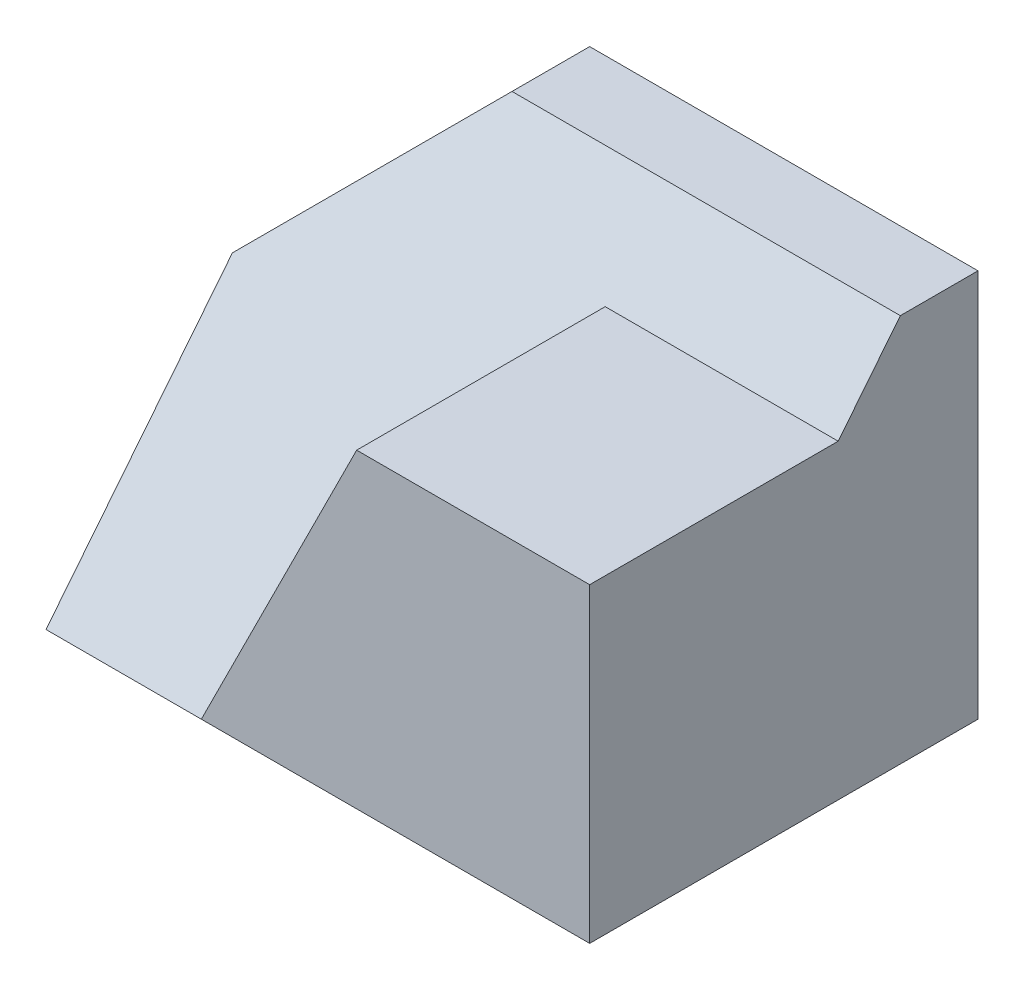
ISO-10303-21;
HEADER;
FILE_DESCRIPTION(('STEP AP214'),'2;1');
FILE_NAME('part.step','',(''),(''),'','','');
FILE_SCHEMA(('AUTOMOTIVE_DESIGN { 1 0 10303 214 1 1 1 1 }'));
ENDSEC;
DATA;
#1=APPLICATION_CONTEXT('core data for automotive mechanical design processes');
#2=APPLICATION_PROTOCOL_DEFINITION('international standard','automotive_design',2000,#1);
#3=PRODUCT_CONTEXT('',#1,'mechanical');
#4=PRODUCT('Part','Part','',(#3));
#5=PRODUCT_RELATED_PRODUCT_CATEGORY('part','',(#4));
#6=PRODUCT_DEFINITION_FORMATION('','',#4);
#7=PRODUCT_DEFINITION_CONTEXT('part definition',#1,'design');
#8=PRODUCT_DEFINITION('design','',#6,#7);
#9=PRODUCT_DEFINITION_SHAPE('','',#8);
#10=(LENGTH_UNIT() NAMED_UNIT(*) SI_UNIT(.MILLI.,.METRE.));
#11=(NAMED_UNIT(*) PLANE_ANGLE_UNIT() SI_UNIT($,.RADIAN.));
#12=(NAMED_UNIT(*) SI_UNIT($,.STERADIAN.) SOLID_ANGLE_UNIT());
#13=UNCERTAINTY_MEASURE_WITH_UNIT(LENGTH_MEASURE(1.E-05),#10,'distance_accuracy_value','');
#14=(GEOMETRIC_REPRESENTATION_CONTEXT(3) GLOBAL_UNCERTAINTY_ASSIGNED_CONTEXT((#13)) GLOBAL_UNIT_ASSIGNED_CONTEXT((#10,
#11,#12)) REPRESENTATION_CONTEXT('',''));
#15=CARTESIAN_POINT('',(0.,0.,0.));
#16=DIRECTION('',(0.,0.,1.));
#17=DIRECTION('',(1.,0.,0.));
#18=AXIS2_PLACEMENT_3D('',#15,#16,#17);
#19=CARTESIAN_POINT('',(0.,24.390243902439,30.4878048780488));
#20=DIRECTION('',(0.,0.624695047554424,0.78086880944303));
#21=DIRECTION('',(0.,-0.78086880944303,0.624695047554424));
#22=AXIS2_PLACEMENT_3D('',#19,#20,#21);
#23=PLANE('',#22);
#24=DIRECTION('',(1.,0.,0.));
#25=VECTOR('',#24,1.);
#26=CARTESIAN_POINT('',(0.,0.,50.));
#27=LINE('',#26,#25);
#28=CARTESIAN_POINT('',(0.,0.,50.));
#29=VERTEX_POINT('',#28);
#30=CARTESIAN_POINT('',(20.,0.,50.));
#31=VERTEX_POINT('',#30);
#32=EDGE_CURVE('E110',#29,#31,#27,.T.);
#33=ORIENTED_EDGE('',*,*,#32,.T.);
#34=DIRECTION('',(-0.363696483726654,-0.727392967453308,0.581914373962646));
#35=VECTOR('',#34,1.);
#36=CARTESIAN_POINT('',(27.9365079365079,15.8730158730159,37.3015873015873));
#37=LINE('',#36,#35);
#38=CARTESIAN_POINT('',(40.,40.,18.));
#39=VERTEX_POINT('',#38);
#40=EDGE_CURVE('E11',#39,#31,#37,.T.);
#41=ORIENTED_EDGE('',*,*,#40,.F.);
#42=DIRECTION('',(-1.,0.,0.));
#43=VECTOR('',#42,1.);
#44=CARTESIAN_POINT('',(0.,40.,18.));
#45=LINE('',#44,#43);
#46=CARTESIAN_POINT('',(70.,40.,18.));
#47=VERTEX_POINT('',#46);
#48=EDGE_CURVE('E57',#47,#39,#45,.T.);
#49=ORIENTED_EDGE('',*,*,#48,.F.);
#50=DIRECTION('',(0.,0.780868809443031,-0.624695047554424));
#51=VECTOR('',#50,1.);
#52=CARTESIAN_POINT('',(70.,50.,10.));
#53=LINE('',#52,#51);
#54=CARTESIAN_POINT('',(70.,50.,10.));
#55=VERTEX_POINT('',#54);
#56=EDGE_CURVE('E125',#47,#55,#53,.T.);
#57=ORIENTED_EDGE('',*,*,#56,.T.);
#58=DIRECTION('',(1.,0.,0.));
#59=VECTOR('',#58,1.);
#60=CARTESIAN_POINT('',(-11.,50.,10.));
#61=LINE('',#60,#59);
#62=CARTESIAN_POINT('',(20.,50.,10.));
#63=VERTEX_POINT('',#62);
#64=EDGE_CURVE('E133',#63,#55,#61,.T.);
#65=ORIENTED_EDGE('',*,*,#64,.F.);
#66=DIRECTION('',(0.615457454896664,0.615457454896664,-0.492365963917331));
#67=VECTOR('',#66,1.);
#68=CARTESIAN_POINT('',(23.030303030303,53.030303030303,7.57575757575759));
#69=LINE('',#68,#67);
#70=CARTESIAN_POINT('',(0.,30.,26.));
#71=VERTEX_POINT('',#70);
#72=EDGE_CURVE('E39',#71,#63,#69,.T.);
#73=ORIENTED_EDGE('',*,*,#72,.F.);
#74=DIRECTION('',(0.,0.780868809443031,-0.624695047554424));
#75=VECTOR('',#74,1.);
#76=CARTESIAN_POINT('',(0.,0.,50.));
#77=LINE('',#76,#75);
#78=EDGE_CURVE('E127',#29,#71,#77,.T.);
#79=ORIENTED_EDGE('',*,*,#78,.F.);
#80=EDGE_LOOP('',(#33,#41,#49,#57,#65,#73,#79));
#81=FACE_BOUND('',#80,.T.);
#82=ADVANCED_FACE('F35',(#81),#23,.T.);
#83=CARTESIAN_POINT('',(0.,0.,50.));
#84=DIRECTION('',(0.,0.,-1.));
#85=DIRECTION('',(-1.,0.,0.));
#86=AXIS2_PLACEMENT_3D('',#83,#84,#85);
#87=PLANE('',#86);
#88=DIRECTION('',(-0.447213595499958,-0.894427190999916,0.));
#89=VECTOR('',#88,1.);
#90=CARTESIAN_POINT('',(40.,40.,50.));
#91=LINE('',#90,#89);
#92=CARTESIAN_POINT('',(40.,40.,50.));
#93=VERTEX_POINT('',#92);
#94=EDGE_CURVE('E124',#93,#31,#91,.T.);
#95=ORIENTED_EDGE('',*,*,#94,.T.);
#96=DIRECTION('',(-1.,0.,0.));
#97=VECTOR('',#96,1.);
#98=CARTESIAN_POINT('',(0.,0.,50.));
#99=LINE('',#98,#97);
#100=CARTESIAN_POINT('',(70.,0.,50.));
#101=VERTEX_POINT('',#100);
#102=EDGE_CURVE('E115',#101,#31,#99,.T.);
#103=ORIENTED_EDGE('',*,*,#102,.F.);
#104=DIRECTION('',(0.,1.,0.));
#105=VECTOR('',#104,1.);
#106=CARTESIAN_POINT('',(70.,0.,50.));
#107=LINE('',#106,#105);
#108=CARTESIAN_POINT('',(70.,40.,50.));
#109=VERTEX_POINT('',#108);
#110=EDGE_CURVE('E100',#101,#109,#107,.T.);
#111=ORIENTED_EDGE('',*,*,#110,.T.);
#112=DIRECTION('',(1.,0.,0.));
#113=VECTOR('',#112,1.);
#114=CARTESIAN_POINT('',(-11.,40.,50.));
#115=LINE('',#114,#113);
#116=EDGE_CURVE('E132',#93,#109,#115,.T.);
#117=ORIENTED_EDGE('',*,*,#116,.F.);
#118=EDGE_LOOP('',(#95,#103,#111,#117));
#119=FACE_BOUND('',#118,.T.);
#120=ADVANCED_FACE('F123',(#119),#87,.F.);
#121=CARTESIAN_POINT('',(-11.,40.,50.));
#122=DIRECTION('',(0.,-1.,0.));
#123=DIRECTION('',(0.,0.,-1.));
#124=AXIS2_PLACEMENT_3D('',#121,#122,#123);
#125=PLANE('',#124);
#126=DIRECTION('',(0.,0.,-1.));
#127=VECTOR('',#126,1.);
#128=CARTESIAN_POINT('',(70.,40.,50.));
#129=LINE('',#128,#127);
#130=EDGE_CURVE('E106',#109,#47,#129,.T.);
#131=ORIENTED_EDGE('',*,*,#130,.T.);
#132=ORIENTED_EDGE('',*,*,#48,.T.);
#133=DIRECTION('',(0.,0.,1.));
#134=VECTOR('',#133,1.);
#135=CARTESIAN_POINT('',(40.,40.,9.99999999999999));
#136=LINE('',#135,#134);
#137=EDGE_CURVE('E139',#39,#93,#136,.T.);
#138=ORIENTED_EDGE('',*,*,#137,.T.);
#139=ORIENTED_EDGE('',*,*,#116,.T.);
#140=EDGE_LOOP('',(#131,#132,#138,#139));
#141=FACE_BOUND('',#140,.T.);
#142=ADVANCED_FACE('F191',(#141),#125,.F.);
#143=CARTESIAN_POINT('',(40.,40.,9.99999999999999));
#144=DIRECTION('',(-0.894427190999916,0.447213595499958,0.));
#145=DIRECTION('',(-0.447213595499958,-0.894427190999916,0.));
#146=AXIS2_PLACEMENT_3D('',#143,#144,#145);
#147=PLANE('',#146);
#148=ORIENTED_EDGE('',*,*,#40,.T.);
#149=ORIENTED_EDGE('',*,*,#94,.F.);
#150=ORIENTED_EDGE('',*,*,#137,.F.);
#151=EDGE_LOOP('',(#148,#149,#150));
#152=FACE_BOUND('',#151,.T.);
#153=ADVANCED_FACE('F196',(#152),#147,.T.);
#154=CARTESIAN_POINT('',(0.,0.,50.));
#155=DIRECTION('',(1.,0.,0.));
#156=DIRECTION('',(0.,0.,-1.));
#157=AXIS2_PLACEMENT_3D('',#154,#155,#156);
#158=PLANE('',#157);
#159=ORIENTED_EDGE('',*,*,#78,.T.);
#160=DIRECTION('',(0.,0.,1.));
#161=VECTOR('',#160,1.);
#162=CARTESIAN_POINT('',(0.,30.,0.));
#163=LINE('',#162,#161);
#164=CARTESIAN_POINT('',(0.,30.,0.));
#165=VERTEX_POINT('',#164);
#166=EDGE_CURVE('E121',#165,#71,#163,.T.);
#167=ORIENTED_EDGE('',*,*,#166,.F.);
#168=DIRECTION('',(0.,-1.,0.));
#169=VECTOR('',#168,1.);
#170=CARTESIAN_POINT('',(0.,0.,0.));
#171=LINE('',#170,#169);
#172=CARTESIAN_POINT('',(0.,0.,0.));
#173=VERTEX_POINT('',#172);
#174=EDGE_CURVE('E147',#165,#173,#171,.T.);
#175=ORIENTED_EDGE('',*,*,#174,.T.);
#176=DIRECTION('',(0.,0.,-1.));
#177=VECTOR('',#176,1.);
#178=CARTESIAN_POINT('',(0.,0.,50.));
#179=LINE('',#178,#177);
#180=EDGE_CURVE('E142',#29,#173,#179,.T.);
#181=ORIENTED_EDGE('',*,*,#180,.F.);
#182=EDGE_LOOP('',(#159,#167,#175,#181));
#183=FACE_BOUND('',#182,.T.);
#184=ADVANCED_FACE('F37',(#183),#158,.F.);
#185=CARTESIAN_POINT('',(0.,0.,0.));
#186=DIRECTION('',(0.,0.,-1.));
#187=DIRECTION('',(-1.,0.,0.));
#188=AXIS2_PLACEMENT_3D('',#185,#186,#187);
#189=PLANE('',#188);
#190=ORIENTED_EDGE('',*,*,#174,.F.);
#191=DIRECTION('',(0.707106781186548,0.707106781186548,0.));
#192=VECTOR('',#191,1.);
#193=CARTESIAN_POINT('',(20.,50.,0.));
#194=LINE('',#193,#192);
#195=CARTESIAN_POINT('',(20.,50.,0.));
#196=VERTEX_POINT('',#195);
#197=EDGE_CURVE('E131',#165,#196,#194,.T.);
#198=ORIENTED_EDGE('',*,*,#197,.T.);
#199=DIRECTION('',(-1.,0.,0.));
#200=VECTOR('',#199,1.);
#201=CARTESIAN_POINT('',(0.,50.,0.));
#202=LINE('',#201,#200);
#203=CARTESIAN_POINT('',(70.,50.,0.));
#204=VERTEX_POINT('',#203);
#205=EDGE_CURVE('E44',#204,#196,#202,.T.);
#206=ORIENTED_EDGE('',*,*,#205,.F.);
#207=DIRECTION('',(0.,1.,0.));
#208=VECTOR('',#207,1.);
#209=CARTESIAN_POINT('',(70.,0.,0.));
#210=LINE('',#209,#208);
#211=CARTESIAN_POINT('',(70.,0.,0.));
#212=VERTEX_POINT('',#211);
#213=EDGE_CURVE('E120',#212,#204,#210,.T.);
#214=ORIENTED_EDGE('',*,*,#213,.F.);
#215=DIRECTION('',(1.,0.,0.));
#216=VECTOR('',#215,1.);
#217=CARTESIAN_POINT('',(0.,0.,0.));
#218=LINE('',#217,#216);
#219=CARTESIAN_POINT('',(44.390243902439,0.,0.));
#220=VERTEX_POINT('',#219);
#221=EDGE_CURVE('E118',#220,#212,#218,.T.);
#222=ORIENTED_EDGE('',*,*,#221,.F.);
#223=EDGE_CURVE('E150',#173,#220,#218,.T.);
#224=ORIENTED_EDGE('',*,*,#223,.F.);
#225=EDGE_LOOP('',(#190,#198,#206,#214,#222,#224));
#226=FACE_BOUND('',#225,.T.);
#227=ADVANCED_FACE('F173',(#226),#189,.T.);
#228=CARTESIAN_POINT('',(0.,0.,50.));
#229=DIRECTION('',(0.,1.,0.));
#230=DIRECTION('',(0.,0.,1.));
#231=AXIS2_PLACEMENT_3D('',#228,#229,#230);
#232=PLANE('',#231);
#233=ORIENTED_EDGE('',*,*,#102,.T.);
#234=ORIENTED_EDGE('',*,*,#32,.F.);
#235=ORIENTED_EDGE('',*,*,#180,.T.);
#236=ORIENTED_EDGE('',*,*,#223,.T.);
#237=ORIENTED_EDGE('',*,*,#221,.T.);
#238=DIRECTION('',(0.,0.,-1.));
#239=VECTOR('',#238,1.);
#240=CARTESIAN_POINT('',(70.,0.,50.));
#241=LINE('',#240,#239);
#242=EDGE_CURVE('E104',#101,#212,#241,.T.);
#243=ORIENTED_EDGE('',*,*,#242,.F.);
#244=EDGE_LOOP('',(#233,#234,#235,#236,#237,#243));
#245=FACE_BOUND('',#244,.T.);
#246=ADVANCED_FACE('F114',(#245),#232,.F.);
#247=CARTESIAN_POINT('',(20.,50.,0.));
#248=DIRECTION('',(0.707106781186548,-0.707106781186548,0.));
#249=DIRECTION('',(0.707106781186548,0.707106781186548,0.));
#250=AXIS2_PLACEMENT_3D('',#247,#248,#249);
#251=PLANE('',#250);
#252=ORIENTED_EDGE('',*,*,#166,.T.);
#253=ORIENTED_EDGE('',*,*,#72,.T.);
#254=DIRECTION('',(0.,0.,1.));
#255=VECTOR('',#254,1.);
#256=CARTESIAN_POINT('',(20.,50.,0.));
#257=LINE('',#256,#255);
#258=EDGE_CURVE('E137',#196,#63,#257,.T.);
#259=ORIENTED_EDGE('',*,*,#258,.F.);
#260=ORIENTED_EDGE('',*,*,#197,.F.);
#261=EDGE_LOOP('',(#252,#253,#259,#260));
#262=FACE_BOUND('',#261,.T.);
#263=ADVANCED_FACE('F170',(#262),#251,.F.);
#264=CARTESIAN_POINT('',(70.,0.,50.));
#265=DIRECTION('',(-1.,0.,0.));
#266=DIRECTION('',(0.,0.,1.));
#267=AXIS2_PLACEMENT_3D('',#264,#265,#266);
#268=PLANE('',#267);
#269=ORIENTED_EDGE('',*,*,#56,.F.);
#270=ORIENTED_EDGE('',*,*,#130,.F.);
#271=ORIENTED_EDGE('',*,*,#110,.F.);
#272=ORIENTED_EDGE('',*,*,#242,.T.);
#273=ORIENTED_EDGE('',*,*,#213,.T.);
#274=DIRECTION('',(0.,0.,-1.));
#275=VECTOR('',#274,1.);
#276=CARTESIAN_POINT('',(70.,50.,50.));
#277=LINE('',#276,#275);
#278=EDGE_CURVE('E136',#55,#204,#277,.T.);
#279=ORIENTED_EDGE('',*,*,#278,.F.);
#280=EDGE_LOOP('',(#269,#270,#271,#272,#273,#279));
#281=FACE_BOUND('',#280,.T.);
#282=ADVANCED_FACE('F103',(#281),#268,.F.);
#283=CARTESIAN_POINT('',(0.,50.,50.));
#284=DIRECTION('',(0.,-1.,0.));
#285=DIRECTION('',(0.,0.,-1.));
#286=AXIS2_PLACEMENT_3D('',#283,#284,#285);
#287=PLANE('',#286);
#288=ORIENTED_EDGE('',*,*,#258,.T.);
#289=ORIENTED_EDGE('',*,*,#64,.T.);
#290=ORIENTED_EDGE('',*,*,#278,.T.);
#291=ORIENTED_EDGE('',*,*,#205,.T.);
#292=EDGE_LOOP('',(#288,#289,#290,#291));
#293=FACE_BOUND('',#292,.T.);
#294=ADVANCED_FACE('F176',(#293),#287,.F.);
#295=CLOSED_SHELL('',(#82,#120,#142,#153,#184,#227,#246,#263,#282,#294));
#296=MANIFOLD_SOLID_BREP('B2',#295);
#297=ADVANCED_BREP_SHAPE_REPRESENTATION('',(#18,#296),#14);
#298=SHAPE_DEFINITION_REPRESENTATION(#9,#297);
ENDSEC;
END-ISO-10303-21;
